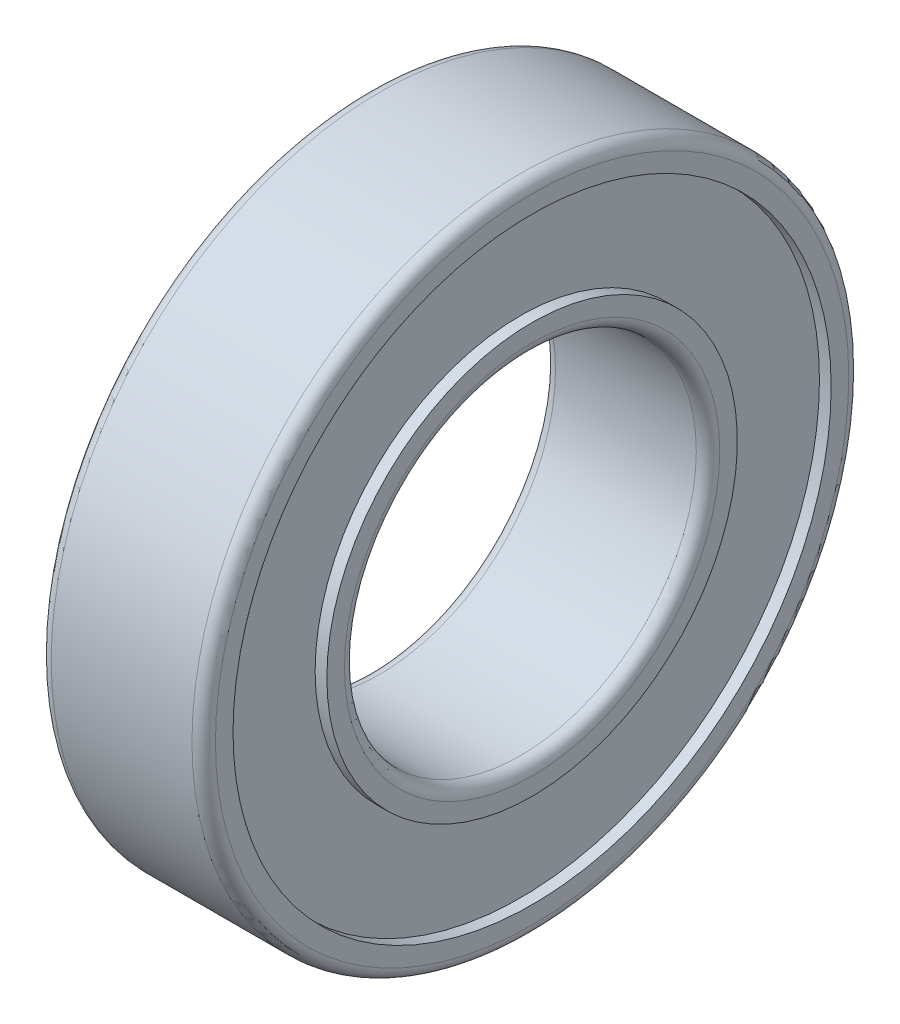
ISO-10303-21;
HEADER;
FILE_DESCRIPTION(('STEP AP214'),'2;1');
FILE_NAME('part.step','',(''),(''),'','','');
FILE_SCHEMA(('AUTOMOTIVE_DESIGN { 1 0 10303 214 1 1 1 1 }'));
ENDSEC;
DATA;
#1=APPLICATION_CONTEXT('core data for automotive mechanical design processes');
#2=APPLICATION_PROTOCOL_DEFINITION('international standard','automotive_design',2000,#1);
#3=PRODUCT_CONTEXT('',#1,'mechanical');
#4=PRODUCT('Part','Part','',(#3));
#5=PRODUCT_RELATED_PRODUCT_CATEGORY('part','',(#4));
#6=PRODUCT_DEFINITION_FORMATION('','',#4);
#7=PRODUCT_DEFINITION_CONTEXT('part definition',#1,'design');
#8=PRODUCT_DEFINITION('design','',#6,#7);
#9=PRODUCT_DEFINITION_SHAPE('','',#8);
#10=(LENGTH_UNIT() NAMED_UNIT(*) SI_UNIT(.MILLI.,.METRE.));
#11=(NAMED_UNIT(*) PLANE_ANGLE_UNIT() SI_UNIT($,.RADIAN.));
#12=(NAMED_UNIT(*) SI_UNIT($,.STERADIAN.) SOLID_ANGLE_UNIT());
#13=UNCERTAINTY_MEASURE_WITH_UNIT(LENGTH_MEASURE(1.E-05),#10,'distance_accuracy_value','');
#14=(GEOMETRIC_REPRESENTATION_CONTEXT(3) GLOBAL_UNCERTAINTY_ASSIGNED_CONTEXT((#13)) GLOBAL_UNIT_ASSIGNED_CONTEXT((#10,
#11,#12)) REPRESENTATION_CONTEXT('',''));
#15=CARTESIAN_POINT('',(0.,0.,0.));
#16=DIRECTION('',(0.,0.,1.));
#17=DIRECTION('',(1.,0.,0.));
#18=AXIS2_PLACEMENT_3D('',#15,#16,#17);
#19=CARTESIAN_POINT('',(6.50000000000035,8.75000000000006,0.));
#20=DIRECTION('',(-1.,0.,0.));
#21=DIRECTION('',(0.,0.,1.));
#22=AXIS2_PLACEMENT_3D('',#19,#20,#21);
#23=PLANE('',#22);
#24=CARTESIAN_POINT('',(6.50000000000001,0.,0.));
#25=DIRECTION('',(-1.,0.,0.));
#26=DIRECTION('',(0.,0.,1.));
#27=AXIS2_PLACEMENT_3D('',#24,#25,#26);
#28=CIRCLE('',#27,8.75000000000004);
#29=CARTESIAN_POINT('',(6.50000000000001,0.,8.75000000000004));
#30=VERTEX_POINT('',#29);
#31=EDGE_CURVE('E297',#30,#30,#28,.F.);
#32=ORIENTED_EDGE('',*,*,#31,.F.);
#33=EDGE_LOOP('',(#32));
#34=FACE_BOUND('',#33,.T.);
#35=CARTESIAN_POINT('',(6.50000000000001,0.,0.));
#36=DIRECTION('',(-1.,0.,0.));
#37=DIRECTION('',(0.,0.,1.));
#38=AXIS2_PLACEMENT_3D('',#35,#36,#37);
#39=CIRCLE('',#38,12.7500000000001);
#40=CARTESIAN_POINT('',(6.50000000000001,0.,12.7500000000001));
#41=VERTEX_POINT('',#40);
#42=EDGE_CURVE('E295',#41,#41,#39,.F.);
#43=ORIENTED_EDGE('',*,*,#42,.T.);
#44=EDGE_LOOP('',(#43));
#45=FACE_BOUND('',#44,.T.);
#46=ADVANCED_FACE('F17',(#34,#45),#23,.F.);
#47=CARTESIAN_POINT('',(0.,0.,0.));
#48=DIRECTION('',(-1.,0.,0.));
#49=DIRECTION('',(0.,0.,1.));
#50=AXIS2_PLACEMENT_3D('',#47,#48,#49);
#51=CYLINDRICAL_SURFACE('',#50,8.75000000000004);
#52=ORIENTED_EDGE('',*,*,#31,.T.);
#53=EDGE_LOOP('',(#52));
#54=FACE_BOUND('',#53,.T.);
#55=CARTESIAN_POINT('',(7.00000000000001,0.,0.));
#56=DIRECTION('',(-1.,0.,0.));
#57=DIRECTION('',(0.,0.,1.));
#58=AXIS2_PLACEMENT_3D('',#55,#56,#57);
#59=CIRCLE('',#58,8.75000000000004);
#60=CARTESIAN_POINT('',(7.00000000000001,0.,8.75000000000004));
#61=VERTEX_POINT('',#60);
#62=EDGE_CURVE('E292',#61,#61,#59,.T.);
#63=ORIENTED_EDGE('',*,*,#62,.T.);
#64=EDGE_LOOP('',(#63));
#65=FACE_BOUND('',#64,.T.);
#66=ADVANCED_FACE('F102',(#54,#65),#51,.T.);
#67=CARTESIAN_POINT('',(0.,0.,0.));
#68=DIRECTION('',(-1.,0.,0.));
#69=DIRECTION('',(0.,0.,1.));
#70=AXIS2_PLACEMENT_3D('',#67,#68,#69);
#71=CYLINDRICAL_SURFACE('',#70,12.7500000000001);
#72=CARTESIAN_POINT('',(7.00000000000001,0.,0.));
#73=DIRECTION('',(-1.,0.,0.));
#74=DIRECTION('',(0.,0.,1.));
#75=AXIS2_PLACEMENT_3D('',#72,#73,#74);
#76=CIRCLE('',#75,12.7500000000001);
#77=CARTESIAN_POINT('',(7.00000000000001,0.,12.7500000000001));
#78=VERTEX_POINT('',#77);
#79=EDGE_CURVE('E70',#78,#78,#76,.F.);
#80=ORIENTED_EDGE('',*,*,#79,.T.);
#81=EDGE_LOOP('',(#80));
#82=FACE_BOUND('',#81,.T.);
#83=ORIENTED_EDGE('',*,*,#42,.F.);
#84=EDGE_LOOP('',(#83));
#85=FACE_BOUND('',#84,.T.);
#86=ADVANCED_FACE('F90',(#82,#85),#71,.F.);
#87=CARTESIAN_POINT('',(7.00000000000001,7.50000000000007,0.));
#88=DIRECTION('',(-1.,0.,0.));
#89=DIRECTION('',(0.,0.,1.));
#90=AXIS2_PLACEMENT_3D('',#87,#88,#89);
#91=PLANE('',#90);
#92=ORIENTED_EDGE('',*,*,#62,.F.);
#93=EDGE_LOOP('',(#92));
#94=FACE_BOUND('',#93,.T.);
#95=CARTESIAN_POINT('',(7.00000000000001,0.,0.));
#96=DIRECTION('',(1.,0.,0.));
#97=DIRECTION('',(0.,0.,1.));
#98=AXIS2_PLACEMENT_3D('',#95,#96,#97);
#99=CIRCLE('',#98,8.00000000000004);
#100=CARTESIAN_POINT('',(7.00000000000001,0.,8.00000000000004));
#101=VERTEX_POINT('',#100);
#102=CARTESIAN_POINT('',(7.00000000000001,0.,-8.00000000000004));
#103=VERTEX_POINT('',#102);
#104=EDGE_CURVE('E57',#101,#103,#99,.T.);
#105=ORIENTED_EDGE('',*,*,#104,.F.);
#106=CARTESIAN_POINT('',(7.00000000000001,0.,0.));
#107=DIRECTION('',(1.,0.,0.));
#108=DIRECTION('',(0.,0.,-1.));
#109=AXIS2_PLACEMENT_3D('',#106,#107,#108);
#110=CIRCLE('',#109,8.00000000000004);
#111=EDGE_CURVE('E59',#103,#101,#110,.T.);
#112=ORIENTED_EDGE('',*,*,#111,.F.);
#113=EDGE_LOOP('',(#105,#112));
#114=FACE_BOUND('',#113,.T.);
#115=ADVANCED_FACE('F69',(#94,#114),#91,.F.);
#116=CARTESIAN_POINT('',(7.00000000000035,12.7500000000001,0.));
#117=DIRECTION('',(-1.,0.,0.));
#118=DIRECTION('',(0.,0.,1.));
#119=AXIS2_PLACEMENT_3D('',#116,#117,#118);
#120=PLANE('',#119);
#121=ORIENTED_EDGE('',*,*,#79,.F.);
#122=EDGE_LOOP('',(#121));
#123=FACE_BOUND('',#122,.T.);
#124=CARTESIAN_POINT('',(7.00000000000001,0.,0.));
#125=DIRECTION('',(-1.,0.,0.));
#126=DIRECTION('',(0.,0.,1.));
#127=AXIS2_PLACEMENT_3D('',#124,#125,#126);
#128=CIRCLE('',#127,13.5000000000001);
#129=CARTESIAN_POINT('',(7.00000000000014,0.,13.5));
#130=VERTEX_POINT('',#129);
#131=CARTESIAN_POINT('',(7.00000000000014,0.,-13.5));
#132=VERTEX_POINT('',#131);
#133=EDGE_CURVE('E65',#130,#132,#128,.T.);
#134=ORIENTED_EDGE('',*,*,#133,.F.);
#135=CARTESIAN_POINT('',(7.00000000000001,0.,0.));
#136=DIRECTION('',(-1.,0.,0.));
#137=DIRECTION('',(0.,0.,-1.));
#138=AXIS2_PLACEMENT_3D('',#135,#136,#137);
#139=CIRCLE('',#138,13.5);
#140=EDGE_CURVE('E238',#132,#130,#139,.T.);
#141=ORIENTED_EDGE('',*,*,#140,.F.);
#142=EDGE_LOOP('',(#134,#141));
#143=FACE_BOUND('',#142,.T.);
#144=ADVANCED_FACE('F89',(#123,#143),#120,.F.);
#145=CARTESIAN_POINT('',(6.50000000000001,0.,0.));
#146=DIRECTION('',(-1.,0.,0.));
#147=DIRECTION('',(0.,0.,1.));
#148=AXIS2_PLACEMENT_3D('',#145,#146,#147);
#149=TOROIDAL_SURFACE('',#148,8.,0.5);
#150=ORIENTED_EDGE('',*,*,#104,.T.);
#151=ORIENTED_EDGE('',*,*,#111,.T.);
#152=EDGE_LOOP('',(#150,#151));
#153=FACE_BOUND('',#152,.T.);
#154=CARTESIAN_POINT('',(6.50000000000001,0.,0.));
#155=DIRECTION('',(-1.,0.,0.));
#156=DIRECTION('',(0.,0.,1.));
#157=AXIS2_PLACEMENT_3D('',#154,#155,#156);
#158=CIRCLE('',#157,7.50000000000004);
#159=CARTESIAN_POINT('',(6.50000000000001,0.,7.50000000000004));
#160=VERTEX_POINT('',#159);
#161=EDGE_CURVE('E236',#160,#160,#158,.T.);
#162=ORIENTED_EDGE('',*,*,#161,.T.);
#163=EDGE_LOOP('',(#162));
#164=FACE_BOUND('',#163,.T.);
#165=ADVANCED_FACE('F61',(#153,#164),#149,.T.);
#166=CARTESIAN_POINT('',(6.50000000000001,0.,0.));
#167=DIRECTION('',(-1.,0.,0.));
#168=DIRECTION('',(0.,0.,1.));
#169=AXIS2_PLACEMENT_3D('',#166,#167,#168);
#170=TOROIDAL_SURFACE('',#169,13.5,0.5);
#171=ORIENTED_EDGE('',*,*,#133,.T.);
#172=ORIENTED_EDGE('',*,*,#140,.T.);
#173=EDGE_LOOP('',(#171,#172));
#174=FACE_BOUND('',#173,.T.);
#175=CARTESIAN_POINT('',(6.50000000000001,0.,0.));
#176=DIRECTION('',(-1.,0.,0.));
#177=DIRECTION('',(0.,0.,1.));
#178=AXIS2_PLACEMENT_3D('',#175,#176,#177);
#179=CIRCLE('',#178,14.0000000000001);
#180=CARTESIAN_POINT('',(6.50000000000001,0.,14.0000000000001));
#181=VERTEX_POINT('',#180);
#182=EDGE_CURVE('E234',#181,#181,#179,.T.);
#183=ORIENTED_EDGE('',*,*,#182,.F.);
#184=EDGE_LOOP('',(#183));
#185=FACE_BOUND('',#184,.T.);
#186=ADVANCED_FACE('F217',(#174,#185),#170,.T.);
#187=CARTESIAN_POINT('',(0.,0.,0.));
#188=DIRECTION('',(-1.,0.,0.));
#189=DIRECTION('',(0.,0.,1.));
#190=AXIS2_PLACEMENT_3D('',#187,#188,#189);
#191=CYLINDRICAL_SURFACE('',#190,7.50000000000004);
#192=ORIENTED_EDGE('',*,*,#161,.F.);
#193=EDGE_LOOP('',(#192));
#194=FACE_BOUND('',#193,.T.);
#195=CARTESIAN_POINT('',(0.5,0.,0.));
#196=DIRECTION('',(1.,0.,0.));
#197=DIRECTION('',(0.,0.,-1.));
#198=AXIS2_PLACEMENT_3D('',#195,#196,#197);
#199=CIRCLE('',#198,7.5);
#200=CARTESIAN_POINT('',(0.5,0.,-7.5));
#201=VERTEX_POINT('',#200);
#202=EDGE_CURVE('E263',#201,#201,#199,.T.);
#203=ORIENTED_EDGE('',*,*,#202,.F.);
#204=EDGE_LOOP('',(#203));
#205=FACE_BOUND('',#204,.T.);
#206=ADVANCED_FACE('F227',(#194,#205),#191,.F.);
#207=CARTESIAN_POINT('',(0.,0.,0.));
#208=DIRECTION('',(-1.,0.,0.));
#209=DIRECTION('',(0.,0.,1.));
#210=AXIS2_PLACEMENT_3D('',#207,#208,#209);
#211=CYLINDRICAL_SURFACE('',#210,14.0000000000001);
#212=ORIENTED_EDGE('',*,*,#182,.T.);
#213=EDGE_LOOP('',(#212));
#214=FACE_BOUND('',#213,.T.);
#215=CARTESIAN_POINT('',(0.5,0.,0.));
#216=DIRECTION('',(1.,0.,0.));
#217=DIRECTION('',(0.,0.,-1.));
#218=AXIS2_PLACEMENT_3D('',#215,#216,#217);
#219=CIRCLE('',#218,14.);
#220=CARTESIAN_POINT('',(0.5,0.,-14.));
#221=VERTEX_POINT('',#220);
#222=EDGE_CURVE('E265',#221,#221,#219,.F.);
#223=ORIENTED_EDGE('',*,*,#222,.F.);
#224=EDGE_LOOP('',(#223));
#225=FACE_BOUND('',#224,.T.);
#226=ADVANCED_FACE('F323',(#214,#225),#211,.T.);
#227=CARTESIAN_POINT('',(0.5,0.,0.));
#228=DIRECTION('',(1.,0.,0.));
#229=DIRECTION('',(0.,0.,-1.));
#230=AXIS2_PLACEMENT_3D('',#227,#228,#229);
#231=TOROIDAL_SURFACE('',#230,8.,0.5);
#232=CARTESIAN_POINT('',(0.,0.,0.));
#233=DIRECTION('',(-1.,0.,0.));
#234=DIRECTION('',(0.,0.,-1.));
#235=AXIS2_PLACEMENT_3D('',#232,#233,#234);
#236=CIRCLE('',#235,8.00000000000002);
#237=CARTESIAN_POINT('',(1.44589201722667E-13,0.,-8.00000000000003));
#238=VERTEX_POINT('',#237);
#239=CARTESIAN_POINT('',(1.44589201722667E-13,0.,8.00000000000003));
#240=VERTEX_POINT('',#239);
#241=EDGE_CURVE('E155',#238,#240,#236,.T.);
#242=ORIENTED_EDGE('',*,*,#241,.T.);
#243=CARTESIAN_POINT('',(0.,0.,0.));
#244=DIRECTION('',(-1.,0.,0.));
#245=DIRECTION('',(0.,0.,1.));
#246=AXIS2_PLACEMENT_3D('',#243,#244,#245);
#247=CIRCLE('',#246,8.00000000000002);
#248=EDGE_CURVE('E166',#240,#238,#247,.T.);
#249=ORIENTED_EDGE('',*,*,#248,.T.);
#250=EDGE_LOOP('',(#242,#249));
#251=FACE_BOUND('',#250,.T.);
#252=ORIENTED_EDGE('',*,*,#202,.T.);
#253=EDGE_LOOP('',(#252));
#254=FACE_BOUND('',#253,.T.);
#255=ADVANCED_FACE('F182',(#251,#254),#231,.T.);
#256=CARTESIAN_POINT('',(0.5,0.,0.));
#257=DIRECTION('',(1.,0.,0.));
#258=DIRECTION('',(0.,0.,-1.));
#259=AXIS2_PLACEMENT_3D('',#256,#257,#258);
#260=TOROIDAL_SURFACE('',#259,13.5,0.5);
#261=CARTESIAN_POINT('',(0.,0.,0.));
#262=DIRECTION('',(1.,0.,0.));
#263=DIRECTION('',(0.,0.,-1.));
#264=AXIS2_PLACEMENT_3D('',#261,#262,#263);
#265=CIRCLE('',#264,13.5);
#266=CARTESIAN_POINT('',(0.,0.,-13.5));
#267=VERTEX_POINT('',#266);
#268=CARTESIAN_POINT('',(0.,0.,13.5));
#269=VERTEX_POINT('',#268);
#270=EDGE_CURVE('E280',#267,#269,#265,.T.);
#271=ORIENTED_EDGE('',*,*,#270,.T.);
#272=CARTESIAN_POINT('',(0.,0.,0.));
#273=DIRECTION('',(1.,0.,0.));
#274=DIRECTION('',(0.,0.,1.));
#275=AXIS2_PLACEMENT_3D('',#272,#273,#274);
#276=CIRCLE('',#275,13.5);
#277=EDGE_CURVE('E36',#269,#267,#276,.T.);
#278=ORIENTED_EDGE('',*,*,#277,.T.);
#279=EDGE_LOOP('',(#271,#278));
#280=FACE_BOUND('',#279,.T.);
#281=ORIENTED_EDGE('',*,*,#222,.T.);
#282=EDGE_LOOP('',(#281));
#283=FACE_BOUND('',#282,.T.);
#284=ADVANCED_FACE('F178',(#280,#283),#260,.T.);
#285=CARTESIAN_POINT('',(3.60822483003176E-13,8.75000000000006,0.));
#286=DIRECTION('',(1.,0.,0.));
#287=DIRECTION('',(0.,0.,-1.));
#288=AXIS2_PLACEMENT_3D('',#285,#286,#287);
#289=PLANE('',#288);
#290=CARTESIAN_POINT('',(0.,0.,0.));
#291=DIRECTION('',(-1.,0.,0.));
#292=DIRECTION('',(0.,0.,1.));
#293=AXIS2_PLACEMENT_3D('',#290,#291,#292);
#294=CIRCLE('',#293,8.75000000000004);
#295=CARTESIAN_POINT('',(0.,0.,8.75000000000004));
#296=VERTEX_POINT('',#295);
#297=EDGE_CURVE('E281',#296,#296,#294,.F.);
#298=ORIENTED_EDGE('',*,*,#297,.F.);
#299=EDGE_LOOP('',(#298));
#300=FACE_BOUND('',#299,.T.);
#301=ORIENTED_EDGE('',*,*,#241,.F.);
#302=ORIENTED_EDGE('',*,*,#248,.F.);
#303=EDGE_LOOP('',(#301,#302));
#304=FACE_BOUND('',#303,.T.);
#305=ADVANCED_FACE('F134',(#300,#304),#289,.F.);
#306=CARTESIAN_POINT('',(0.,14.0000000000001,0.));
#307=DIRECTION('',(1.,0.,0.));
#308=DIRECTION('',(0.,0.,-1.));
#309=AXIS2_PLACEMENT_3D('',#306,#307,#308);
#310=PLANE('',#309);
#311=CARTESIAN_POINT('',(0.,0.,0.));
#312=DIRECTION('',(-1.,0.,0.));
#313=DIRECTION('',(0.,0.,1.));
#314=AXIS2_PLACEMENT_3D('',#311,#312,#313);
#315=CIRCLE('',#314,12.7500000000001);
#316=CARTESIAN_POINT('',(0.,0.,12.7500000000001));
#317=VERTEX_POINT('',#316);
#318=EDGE_CURVE('E283',#317,#317,#315,.F.);
#319=ORIENTED_EDGE('',*,*,#318,.T.);
#320=EDGE_LOOP('',(#319));
#321=FACE_BOUND('',#320,.T.);
#322=ORIENTED_EDGE('',*,*,#270,.F.);
#323=ORIENTED_EDGE('',*,*,#277,.F.);
#324=EDGE_LOOP('',(#322,#323));
#325=FACE_BOUND('',#324,.T.);
#326=ADVANCED_FACE('F129',(#321,#325),#310,.F.);
#327=CARTESIAN_POINT('',(0.,0.,0.));
#328=DIRECTION('',(-1.,0.,0.));
#329=DIRECTION('',(0.,0.,1.));
#330=AXIS2_PLACEMENT_3D('',#327,#328,#329);
#331=CYLINDRICAL_SURFACE('',#330,8.75000000000004);
#332=ORIENTED_EDGE('',*,*,#297,.T.);
#333=EDGE_LOOP('',(#332));
#334=FACE_BOUND('',#333,.T.);
#335=CARTESIAN_POINT('',(0.5,0.,0.));
#336=DIRECTION('',(-1.,0.,0.));
#337=DIRECTION('',(0.,0.,1.));
#338=AXIS2_PLACEMENT_3D('',#335,#336,#337);
#339=CIRCLE('',#338,8.75000000000004);
#340=CARTESIAN_POINT('',(0.5,0.,8.75000000000004));
#341=VERTEX_POINT('',#340);
#342=EDGE_CURVE('E28',#341,#341,#339,.T.);
#343=ORIENTED_EDGE('',*,*,#342,.T.);
#344=EDGE_LOOP('',(#343));
#345=FACE_BOUND('',#344,.T.);
#346=ADVANCED_FACE('F121',(#334,#345),#331,.T.);
#347=CARTESIAN_POINT('',(0.,0.,0.));
#348=DIRECTION('',(-1.,0.,0.));
#349=DIRECTION('',(0.,0.,1.));
#350=AXIS2_PLACEMENT_3D('',#347,#348,#349);
#351=CYLINDRICAL_SURFACE('',#350,12.7500000000001);
#352=CARTESIAN_POINT('',(0.5,0.,0.));
#353=DIRECTION('',(-1.,0.,0.));
#354=DIRECTION('',(0.,0.,1.));
#355=AXIS2_PLACEMENT_3D('',#352,#353,#354);
#356=CIRCLE('',#355,12.7500000000001);
#357=CARTESIAN_POINT('',(0.5,0.,12.7500000000001));
#358=VERTEX_POINT('',#357);
#359=EDGE_CURVE('E11',#358,#358,#356,.F.);
#360=ORIENTED_EDGE('',*,*,#359,.T.);
#361=EDGE_LOOP('',(#360));
#362=FACE_BOUND('',#361,.T.);
#363=ORIENTED_EDGE('',*,*,#318,.F.);
#364=EDGE_LOOP('',(#363));
#365=FACE_BOUND('',#364,.T.);
#366=ADVANCED_FACE('F115',(#362,#365),#351,.F.);
#367=CARTESIAN_POINT('',(0.500000000000361,12.7500000000001,0.));
#368=DIRECTION('',(1.,0.,0.));
#369=DIRECTION('',(0.,0.,-1.));
#370=AXIS2_PLACEMENT_3D('',#367,#368,#369);
#371=PLANE('',#370);
#372=ORIENTED_EDGE('',*,*,#359,.F.);
#373=EDGE_LOOP('',(#372));
#374=FACE_BOUND('',#373,.T.);
#375=ORIENTED_EDGE('',*,*,#342,.F.);
#376=EDGE_LOOP('',(#375));
#377=FACE_BOUND('',#376,.T.);
#378=ADVANCED_FACE('F113',(#374,#377),#371,.F.);
#379=CLOSED_SHELL('',(#46,#66,#86,#115,#144,#165,#186,#206,#226,#255,#284,#305,#326,#346,#366,#378));
#380=MANIFOLD_SOLID_BREP('B1',#379);
#381=ADVANCED_BREP_SHAPE_REPRESENTATION('',(#18,#380),#14);
#382=SHAPE_DEFINITION_REPRESENTATION(#9,#381);
ENDSEC;
END-ISO-10303-21;
